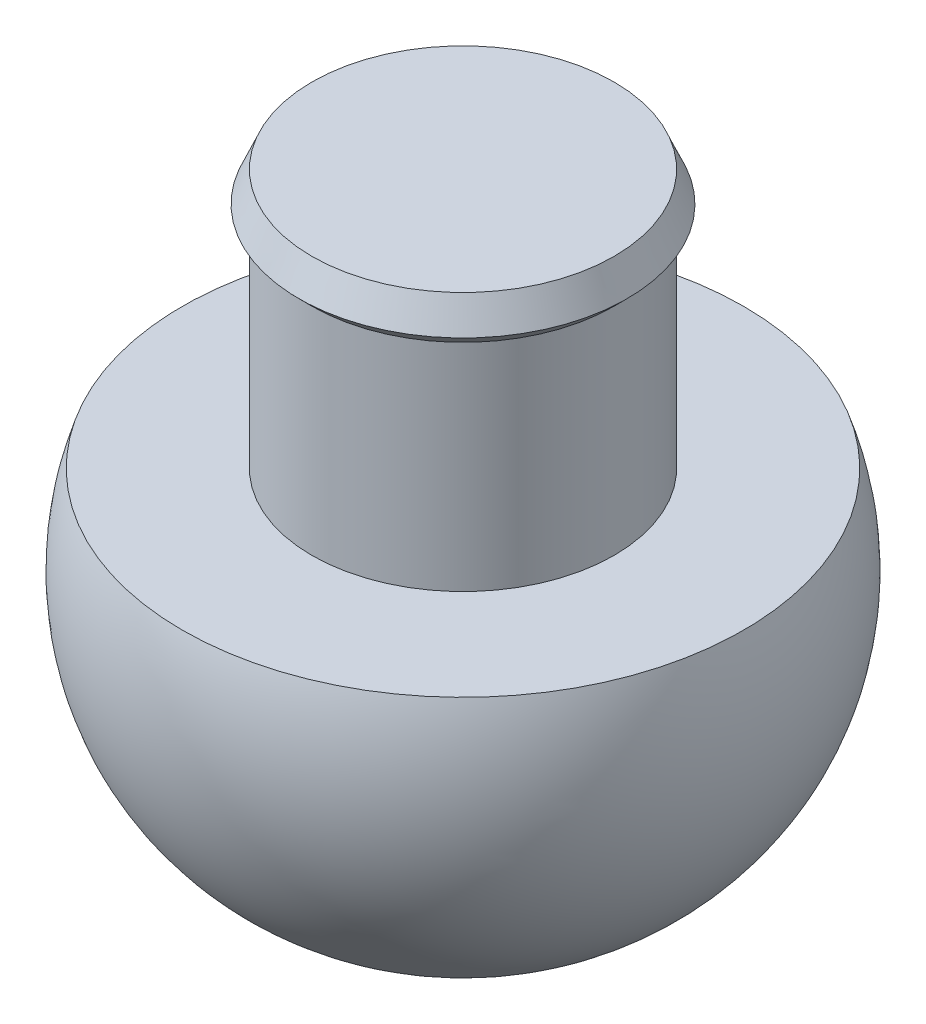
ISO-10303-21;
HEADER;
FILE_DESCRIPTION(('STEP AP214'),'2;1');
FILE_NAME('part.step','',(''),(''),'','','');
FILE_SCHEMA(('AUTOMOTIVE_DESIGN { 1 0 10303 214 1 1 1 1 }'));
ENDSEC;
DATA;
#1=APPLICATION_CONTEXT('core data for automotive mechanical design processes');
#2=APPLICATION_PROTOCOL_DEFINITION('international standard','automotive_design',2000,#1);
#3=PRODUCT_CONTEXT('',#1,'mechanical');
#4=PRODUCT('Part','Part','',(#3));
#5=PRODUCT_RELATED_PRODUCT_CATEGORY('part','',(#4));
#6=PRODUCT_DEFINITION_FORMATION('','',#4);
#7=PRODUCT_DEFINITION_CONTEXT('part definition',#1,'design');
#8=PRODUCT_DEFINITION('design','',#6,#7);
#9=PRODUCT_DEFINITION_SHAPE('','',#8);
#10=(LENGTH_UNIT() NAMED_UNIT(*) SI_UNIT(.MILLI.,.METRE.));
#11=(NAMED_UNIT(*) PLANE_ANGLE_UNIT() SI_UNIT($,.RADIAN.));
#12=(NAMED_UNIT(*) SI_UNIT($,.STERADIAN.) SOLID_ANGLE_UNIT());
#13=UNCERTAINTY_MEASURE_WITH_UNIT(LENGTH_MEASURE(1.E-05),#10,'distance_accuracy_value','');
#14=(GEOMETRIC_REPRESENTATION_CONTEXT(3) GLOBAL_UNCERTAINTY_ASSIGNED_CONTEXT((#13)) GLOBAL_UNIT_ASSIGNED_CONTEXT((#10,
#11,#12)) REPRESENTATION_CONTEXT('',''));
#15=CARTESIAN_POINT('',(0.,0.,0.));
#16=DIRECTION('',(0.,0.,1.));
#17=DIRECTION('',(1.,0.,0.));
#18=AXIS2_PLACEMENT_3D('',#15,#16,#17);
#19=CARTESIAN_POINT('',(-3.5,-3.39005463677118,0.));
#20=DIRECTION('',(0.,-1.,0.));
#21=DIRECTION('',(0.,0.,-1.));
#22=AXIS2_PLACEMENT_3D('',#19,#20,#21);
#23=PLANE('',#22);
#24=CARTESIAN_POINT('',(0.,-3.39005463677118,0.));
#25=DIRECTION('',(0.,-1.,0.));
#26=DIRECTION('',(0.,0.,-1.));
#27=AXIS2_PLACEMENT_3D('',#24,#25,#26);
#28=CIRCLE('',#27,6.5);
#29=CARTESIAN_POINT('',(0.,-3.39005463677118,-6.5));
#30=VERTEX_POINT('',#29);
#31=EDGE_CURVE('E11',#30,#30,#28,.T.);
#32=ORIENTED_EDGE('',*,*,#31,.F.);
#33=EDGE_LOOP('',(#32));
#34=FACE_BOUND('',#33,.T.);
#35=CARTESIAN_POINT('',(0.,-3.39005463677118,0.));
#36=DIRECTION('',(0.,-1.,0.));
#37=DIRECTION('',(0.,0.,-1.));
#38=AXIS2_PLACEMENT_3D('',#35,#36,#37);
#39=CIRCLE('',#38,3.5);
#40=CARTESIAN_POINT('',(0.,-3.39005463677118,-3.5));
#41=VERTEX_POINT('',#40);
#42=EDGE_CURVE('E51',#41,#41,#39,.T.);
#43=ORIENTED_EDGE('',*,*,#42,.T.);
#44=EDGE_LOOP('',(#43));
#45=FACE_BOUND('',#44,.T.);
#46=ADVANCED_FACE('F32',(#34,#45),#23,.F.);
#47=CARTESIAN_POINT('',(0.,-5.43756780135512,-0.362524157800584));
#48=DIRECTION('',(-1.,0.,0.));
#49=DIRECTION('',(0.,0.,-1.));
#50=AXIS2_PLACEMENT_3D('',#47,#48,#49);
#51=CIRCLE('',#50,6.47000153575916);
#52=TRIMMED_CURVE('',#51,(PARAMETER_VALUE(-1.62685722834034)),
(PARAMETER_VALUE(1.62685722834034)),.T.,.PARAMETER.);
#53=CARTESIAN_POINT('',(0.,-5.43756780135512,0.));
#54=DIRECTION('',(0.,-1.,0.));
#55=AXIS1_PLACEMENT('',#53,#54);
#56=SURFACE_OF_REVOLUTION('',#52,#55);
#57=CARTESIAN_POINT('',(0.,-11.8974049593442,0.));
#58=VERTEX_POINT('',#57);
#59=VERTEX_LOOP('',#58);
#60=FACE_BOUND('',#59,.T.);
#61=ORIENTED_EDGE('',*,*,#31,.T.);
#62=EDGE_LOOP('',(#61));
#63=FACE_BOUND('',#62,.T.);
#64=ADVANCED_FACE('F41',(#60,#63),#56,.T.);
#65=CARTESIAN_POINT('',(-3.5,2.60994536322882,0.));
#66=DIRECTION('',(0.,-1.,0.));
#67=DIRECTION('',(0.,0.,-1.));
#68=AXIS2_PLACEMENT_3D('',#65,#66,#67);
#69=PLANE('',#68);
#70=CARTESIAN_POINT('',(0.,2.60994536322882,0.));
#71=DIRECTION('',(0.,-1.,0.));
#72=DIRECTION('',(0.,0.,-1.));
#73=AXIS2_PLACEMENT_3D('',#70,#71,#72);
#74=CIRCLE('',#73,3.5);
#75=CARTESIAN_POINT('',(0.,2.60994536322882,-3.5));
#76=VERTEX_POINT('',#75);
#77=EDGE_CURVE('E38',#76,#76,#74,.T.);
#78=ORIENTED_EDGE('',*,*,#77,.F.);
#79=EDGE_LOOP('',(#78));
#80=FACE_BOUND('',#79,.T.);
#81=ADVANCED_FACE('F44',(#80),#69,.F.);
#82=CARTESIAN_POINT('',(0.,2.60994536322882,0.));
#83=DIRECTION('',(0.,-1.,0.));
#84=DIRECTION('',(0.,0.,-1.));
#85=AXIS2_PLACEMENT_3D('',#82,#83,#84);
#86=CONICAL_SURFACE('',#85,3.5,0.404891786285082);
#87=CARTESIAN_POINT('',(0.,1.90994536322882,0.));
#88=DIRECTION('',(0.,-1.,0.));
#89=DIRECTION('',(0.,0.,-1.));
#90=AXIS2_PLACEMENT_3D('',#87,#88,#89);
#91=CIRCLE('',#90,3.8);
#92=CARTESIAN_POINT('',(0.,1.90994536322882,-3.8));
#93=VERTEX_POINT('',#92);
#94=EDGE_CURVE('E56',#93,#93,#91,.T.);
#95=ORIENTED_EDGE('',*,*,#94,.F.);
#96=EDGE_LOOP('',(#95));
#97=FACE_BOUND('',#96,.T.);
#98=ORIENTED_EDGE('',*,*,#77,.T.);
#99=EDGE_LOOP('',(#98));
#100=FACE_BOUND('',#99,.T.);
#101=ADVANCED_FACE('F63',(#97,#100),#86,.T.);
#102=CARTESIAN_POINT('',(0.,1.90994536322882,0.));
#103=DIRECTION('',(0.,1.,0.));
#104=DIRECTION('',(0.,0.,1.));
#105=AXIS2_PLACEMENT_3D('',#102,#103,#104);
#106=CONICAL_SURFACE('',#105,3.8,0.785398163397448);
#107=CARTESIAN_POINT('',(0.,1.60994536322882,0.));
#108=DIRECTION('',(0.,-1.,0.));
#109=DIRECTION('',(0.,0.,-1.));
#110=AXIS2_PLACEMENT_3D('',#107,#108,#109);
#111=CIRCLE('',#110,3.5);
#112=CARTESIAN_POINT('',(0.,1.60994536322882,-3.5));
#113=VERTEX_POINT('',#112);
#114=EDGE_CURVE('E53',#113,#113,#111,.T.);
#115=ORIENTED_EDGE('',*,*,#114,.F.);
#116=EDGE_LOOP('',(#115));
#117=FACE_BOUND('',#116,.T.);
#118=ORIENTED_EDGE('',*,*,#94,.T.);
#119=EDGE_LOOP('',(#118));
#120=FACE_BOUND('',#119,.T.);
#121=ADVANCED_FACE('F70',(#117,#120),#106,.T.);
#122=CARTESIAN_POINT('',(0.,-11.8974049593442,0.));
#123=DIRECTION('',(0.,-1.,0.));
#124=DIRECTION('',(0.,0.,-1.));
#125=AXIS2_PLACEMENT_3D('',#122,#123,#124);
#126=CYLINDRICAL_SURFACE('',#125,3.5);
#127=ORIENTED_EDGE('',*,*,#42,.F.);
#128=EDGE_LOOP('',(#127));
#129=FACE_BOUND('',#128,.T.);
#130=ORIENTED_EDGE('',*,*,#114,.T.);
#131=EDGE_LOOP('',(#130));
#132=FACE_BOUND('',#131,.T.);
#133=ADVANCED_FACE('F76',(#129,#132),#126,.T.);
#134=CLOSED_SHELL('',(#46,#64,#81,#101,#121,#133));
#135=MANIFOLD_SOLID_BREP('B2',#134);
#136=ADVANCED_BREP_SHAPE_REPRESENTATION('',(#18,#135),#14);
#137=SHAPE_DEFINITION_REPRESENTATION(#9,#136);
ENDSEC;
END-ISO-10303-21;
